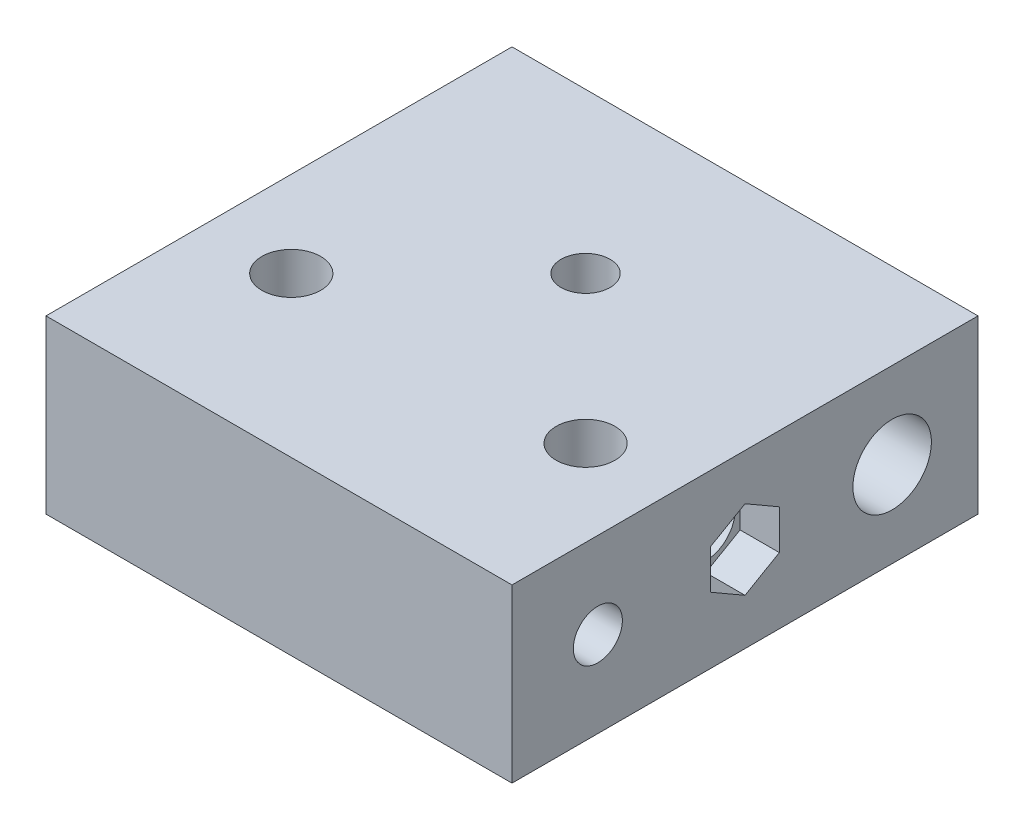
ISO-10303-21;
HEADER;
FILE_DESCRIPTION(('STEP AP214'),'2;1');
FILE_NAME('part.step','',(''),(''),'','','');
FILE_SCHEMA(('AUTOMOTIVE_DESIGN { 1 0 10303 214 1 1 1 1 }'));
ENDSEC;
DATA;
#1=APPLICATION_CONTEXT('core data for automotive mechanical design processes');
#2=APPLICATION_PROTOCOL_DEFINITION('international standard','automotive_design',2000,#1);
#3=PRODUCT_CONTEXT('',#1,'mechanical');
#4=PRODUCT('Part','Part','',(#3));
#5=PRODUCT_RELATED_PRODUCT_CATEGORY('part','',(#4));
#6=PRODUCT_DEFINITION_FORMATION('','',#4);
#7=PRODUCT_DEFINITION_CONTEXT('part definition',#1,'design');
#8=PRODUCT_DEFINITION('design','',#6,#7);
#9=PRODUCT_DEFINITION_SHAPE('','',#8);
#10=(LENGTH_UNIT() NAMED_UNIT(*) SI_UNIT(.MILLI.,.METRE.));
#11=(NAMED_UNIT(*) PLANE_ANGLE_UNIT() SI_UNIT($,.RADIAN.));
#12=(NAMED_UNIT(*) SI_UNIT($,.STERADIAN.) SOLID_ANGLE_UNIT());
#13=UNCERTAINTY_MEASURE_WITH_UNIT(LENGTH_MEASURE(1.E-05),#10,'distance_accuracy_value','');
#14=(GEOMETRIC_REPRESENTATION_CONTEXT(3) GLOBAL_UNCERTAINTY_ASSIGNED_CONTEXT((#13)) GLOBAL_UNIT_ASSIGNED_CONTEXT((#10,
#11,#12)) REPRESENTATION_CONTEXT('',''));
#15=CARTESIAN_POINT('',(0.,0.,0.));
#16=DIRECTION('',(0.,0.,1.));
#17=DIRECTION('',(1.,0.,0.));
#18=AXIS2_PLACEMENT_3D('',#15,#16,#17);
#19=CARTESIAN_POINT('',(47.5,0.,47.5));
#20=DIRECTION('',(-1.,0.,0.));
#21=DIRECTION('',(0.,-1.,0.));
#22=AXIS2_PLACEMENT_3D('',#19,#20,#21);
#23=CYLINDRICAL_SURFACE('',#22,5.99999999999999);
#24=CARTESIAN_POINT('',(-39.5,0.,47.5));
#25=DIRECTION('',(-1.,0.,0.));
#26=DIRECTION('',(0.,0.,1.));
#27=AXIS2_PLACEMENT_3D('',#24,#25,#26);
#28=CIRCLE('',#27,5.99999999999999);
#29=CARTESIAN_POINT('',(-39.5,0.,53.5));
#30=VERTEX_POINT('',#29);
#31=EDGE_CURVE('E276',#30,#30,#28,.F.);
#32=ORIENTED_EDGE('',*,*,#31,.F.);
#33=EDGE_LOOP('',(#32));
#34=FACE_BOUND('',#33,.T.);
#35=CARTESIAN_POINT('',(39.5,0.,47.5));
#36=DIRECTION('',(1.,0.,0.));
#37=DIRECTION('',(0.,0.,-1.));
#38=AXIS2_PLACEMENT_3D('',#35,#36,#37);
#39=CIRCLE('',#38,5.99999999999999);
#40=CARTESIAN_POINT('',(39.5,0.,41.5));
#41=VERTEX_POINT('',#40);
#42=EDGE_CURVE('E37',#41,#41,#39,.F.);
#43=ORIENTED_EDGE('',*,*,#42,.F.);
#44=EDGE_LOOP('',(#43));
#45=FACE_BOUND('',#44,.T.);
#46=ADVANCED_FACE('F33',(#34,#45),#23,.F.);
#47=CARTESIAN_POINT('',(0.,-17.5,32.5));
#48=DIRECTION('',(0.,1.,0.));
#49=DIRECTION('',(0.,0.,1.));
#50=AXIS2_PLACEMENT_3D('',#47,#48,#49);
#51=CYLINDRICAL_SURFACE('',#50,5.);
#52=CARTESIAN_POINT('',(0.,17.5,32.5));
#53=DIRECTION('',(0.,-1.,0.));
#54=DIRECTION('',(0.,0.,-1.));
#55=AXIS2_PLACEMENT_3D('',#52,#53,#54);
#56=CIRCLE('',#55,5.);
#57=CARTESIAN_POINT('',(0.,17.5,27.5));
#58=VERTEX_POINT('',#57);
#59=EDGE_CURVE('E349',#58,#58,#56,.T.);
#60=ORIENTED_EDGE('',*,*,#59,.F.);
#61=EDGE_LOOP('',(#60));
#62=FACE_BOUND('',#61,.T.);
#63=CARTESIAN_POINT('',(0.,-9.50000000000001,32.5));
#64=DIRECTION('',(0.,-1.,0.));
#65=DIRECTION('',(0.,0.,-1.));
#66=AXIS2_PLACEMENT_3D('',#63,#64,#65);
#67=CIRCLE('',#66,5.);
#68=CARTESIAN_POINT('',(0.,-9.50000000000001,27.5));
#69=VERTEX_POINT('',#68);
#70=EDGE_CURVE('E324',#69,#69,#67,.T.);
#71=ORIENTED_EDGE('',*,*,#70,.T.);
#72=EDGE_LOOP('',(#71));
#73=FACE_BOUND('',#72,.T.);
#74=ADVANCED_FACE('F420',(#62,#73),#51,.F.);
#75=CARTESIAN_POINT('',(30.,-17.5,62.5));
#76=DIRECTION('',(0.,1.,0.));
#77=DIRECTION('',(0.,0.,1.));
#78=AXIS2_PLACEMENT_3D('',#75,#76,#77);
#79=CYLINDRICAL_SURFACE('',#78,5.99999999999999);
#80=CARTESIAN_POINT('',(30.,17.5,62.5));
#81=DIRECTION('',(0.,-1.,0.));
#82=DIRECTION('',(0.,0.,-1.));
#83=AXIS2_PLACEMENT_3D('',#80,#81,#82);
#84=CIRCLE('',#83,5.99999999999999);
#85=CARTESIAN_POINT('',(30.,17.5,56.5));
#86=VERTEX_POINT('',#85);
#87=EDGE_CURVE('E342',#86,#86,#84,.T.);
#88=ORIENTED_EDGE('',*,*,#87,.F.);
#89=EDGE_LOOP('',(#88));
#90=FACE_BOUND('',#89,.T.);
#91=CARTESIAN_POINT('',(30.,8.49999999999999,62.5));
#92=DIRECTION('',(0.,-1.,0.));
#93=DIRECTION('',(0.,0.,-1.));
#94=AXIS2_PLACEMENT_3D('',#91,#92,#93);
#95=CIRCLE('',#94,5.99999999999999);
#96=CARTESIAN_POINT('',(30.,8.49999999999999,56.5));
#97=VERTEX_POINT('',#96);
#98=EDGE_CURVE('E338',#97,#97,#95,.T.);
#99=ORIENTED_EDGE('',*,*,#98,.T.);
#100=EDGE_LOOP('',(#99));
#101=FACE_BOUND('',#100,.T.);
#102=ADVANCED_FACE('F512',(#90,#101),#79,.F.);
#103=CARTESIAN_POINT('',(-47.5,17.5,95.));
#104=DIRECTION('',(0.,-1.,0.));
#105=DIRECTION('',(0.,0.,-1.));
#106=AXIS2_PLACEMENT_3D('',#103,#104,#105);
#107=PLANE('',#106);
#108=CARTESIAN_POINT('',(-30.,17.5,62.5));
#109=DIRECTION('',(0.,-1.,0.));
#110=DIRECTION('',(0.,0.,-1.));
#111=AXIS2_PLACEMENT_3D('',#108,#109,#110);
#112=CIRCLE('',#111,6.);
#113=CARTESIAN_POINT('',(-30.,17.5,56.5));
#114=VERTEX_POINT('',#113);
#115=EDGE_CURVE('E345',#114,#114,#112,.T.);
#116=ORIENTED_EDGE('',*,*,#115,.T.);
#117=EDGE_LOOP('',(#116));
#118=FACE_BOUND('',#117,.T.);
#119=DIRECTION('',(-1.,0.,0.));
#120=VECTOR('',#119,1.);
#121=CARTESIAN_POINT('',(-47.5,17.5,0.));
#122=LINE('',#121,#120);
#123=CARTESIAN_POINT('',(47.5,17.5,0.));
#124=VERTEX_POINT('',#123);
#125=CARTESIAN_POINT('',(-47.5,17.5,0.));
#126=VERTEX_POINT('',#125);
#127=EDGE_CURVE('E392',#124,#126,#122,.T.);
#128=ORIENTED_EDGE('',*,*,#127,.T.);
#129=DIRECTION('',(0.,0.,-1.));
#130=VECTOR('',#129,1.);
#131=CARTESIAN_POINT('',(-47.5,17.5,95.));
#132=LINE('',#131,#130);
#133=CARTESIAN_POINT('',(-47.5,17.5,95.));
#134=VERTEX_POINT('',#133);
#135=EDGE_CURVE('E42',#134,#126,#132,.T.);
#136=ORIENTED_EDGE('',*,*,#135,.F.);
#137=DIRECTION('',(-1.,0.,0.));
#138=VECTOR('',#137,1.);
#139=CARTESIAN_POINT('',(-47.5,17.5,95.));
#140=LINE('',#139,#138);
#141=CARTESIAN_POINT('',(47.5,17.5,95.));
#142=VERTEX_POINT('',#141);
#143=EDGE_CURVE('E382',#142,#134,#140,.T.);
#144=ORIENTED_EDGE('',*,*,#143,.F.);
#145=DIRECTION('',(0.,0.,-1.));
#146=VECTOR('',#145,1.);
#147=CARTESIAN_POINT('',(47.5,17.5,95.));
#148=LINE('',#147,#146);
#149=EDGE_CURVE('E11',#142,#124,#148,.T.);
#150=ORIENTED_EDGE('',*,*,#149,.T.);
#151=EDGE_LOOP('',(#128,#136,#144,#150));
#152=FACE_BOUND('',#151,.T.);
#153=ORIENTED_EDGE('',*,*,#59,.T.);
#154=EDGE_LOOP('',(#153));
#155=FACE_BOUND('',#154,.T.);
#156=ORIENTED_EDGE('',*,*,#87,.T.);
#157=EDGE_LOOP('',(#156));
#158=FACE_BOUND('',#157,.T.);
#159=ADVANCED_FACE('F515',(#118,#152,#155,#158),#107,.F.);
#160=CARTESIAN_POINT('',(-47.5,-17.5,95.));
#161=DIRECTION('',(0.,1.,0.));
#162=DIRECTION('',(0.,0.,1.));
#163=AXIS2_PLACEMENT_3D('',#160,#161,#162);
#164=PLANE('',#163);
#165=DIRECTION('',(-0.5,0.,0.866025403784438));
#166=VECTOR('',#165,1.);
#167=CARTESIAN_POINT('',(8.08290376865476,-17.5,32.5));
#168=LINE('',#167,#166);
#169=CARTESIAN_POINT('',(8.08290376865476,-17.5,32.5));
#170=VERTEX_POINT('',#169);
#171=CARTESIAN_POINT('',(4.04145188432738,-17.5,39.5));
#172=VERTEX_POINT('',#171);
#173=EDGE_CURVE('E308',#170,#172,#168,.T.);
#174=ORIENTED_EDGE('',*,*,#173,.F.);
#175=DIRECTION('',(0.5,0.,0.866025403784439));
#176=VECTOR('',#175,1.);
#177=CARTESIAN_POINT('',(4.04145188432738,-17.5,25.5));
#178=LINE('',#177,#176);
#179=CARTESIAN_POINT('',(4.04145188432738,-17.5,25.5));
#180=VERTEX_POINT('',#179);
#181=EDGE_CURVE('E306',#180,#170,#178,.T.);
#182=ORIENTED_EDGE('',*,*,#181,.F.);
#183=DIRECTION('',(1.,0.,0.));
#184=VECTOR('',#183,1.);
#185=CARTESIAN_POINT('',(-4.04145188432738,-17.5,25.5));
#186=LINE('',#185,#184);
#187=CARTESIAN_POINT('',(-4.04145188432738,-17.5,25.5));
#188=VERTEX_POINT('',#187);
#189=EDGE_CURVE('E290',#188,#180,#186,.T.);
#190=ORIENTED_EDGE('',*,*,#189,.F.);
#191=DIRECTION('',(0.5,0.,-0.866025403784438));
#192=VECTOR('',#191,1.);
#193=CARTESIAN_POINT('',(-8.08290376865476,-17.5,32.5));
#194=LINE('',#193,#192);
#195=CARTESIAN_POINT('',(-8.08290376865476,-17.5,32.5));
#196=VERTEX_POINT('',#195);
#197=EDGE_CURVE('E317',#196,#188,#194,.T.);
#198=ORIENTED_EDGE('',*,*,#197,.F.);
#199=DIRECTION('',(-0.5,0.,-0.866025403784439));
#200=VECTOR('',#199,1.);
#201=CARTESIAN_POINT('',(-4.04145188432738,-17.5,39.5));
#202=LINE('',#201,#200);
#203=CARTESIAN_POINT('',(-4.04145188432738,-17.5,39.5));
#204=VERTEX_POINT('',#203);
#205=EDGE_CURVE('E314',#204,#196,#202,.T.);
#206=ORIENTED_EDGE('',*,*,#205,.F.);
#207=DIRECTION('',(-1.,0.,0.));
#208=VECTOR('',#207,1.);
#209=CARTESIAN_POINT('',(4.04145188432738,-17.5,39.5));
#210=LINE('',#209,#208);
#211=EDGE_CURVE('E311',#172,#204,#210,.T.);
#212=ORIENTED_EDGE('',*,*,#211,.F.);
#213=EDGE_LOOP('',(#174,#182,#190,#198,#206,#212));
#214=FACE_BOUND('',#213,.T.);
#215=CARTESIAN_POINT('',(30.,-17.5,62.5));
#216=DIRECTION('',(0.,-1.,0.));
#217=DIRECTION('',(0.,0.,-1.));
#218=AXIS2_PLACEMENT_3D('',#215,#216,#217);
#219=CIRCLE('',#218,8.);
#220=CARTESIAN_POINT('',(30.,-17.5,54.5));
#221=VERTEX_POINT('',#220);
#222=EDGE_CURVE('E339',#221,#221,#219,.T.);
#223=ORIENTED_EDGE('',*,*,#222,.F.);
#224=EDGE_LOOP('',(#223));
#225=FACE_BOUND('',#224,.T.);
#226=CARTESIAN_POINT('',(-30.,-17.5,62.5));
#227=DIRECTION('',(0.,-1.,0.));
#228=DIRECTION('',(0.,0.,-1.));
#229=AXIS2_PLACEMENT_3D('',#226,#227,#228);
#230=CIRCLE('',#229,6.);
#231=CARTESIAN_POINT('',(-30.,-17.5,56.5));
#232=VERTEX_POINT('',#231);
#233=EDGE_CURVE('E346',#232,#232,#230,.T.);
#234=ORIENTED_EDGE('',*,*,#233,.F.);
#235=EDGE_LOOP('',(#234));
#236=FACE_BOUND('',#235,.T.);
#237=DIRECTION('',(1.,0.,0.));
#238=VECTOR('',#237,1.);
#239=CARTESIAN_POINT('',(-47.5,-17.5,0.));
#240=LINE('',#239,#238);
#241=CARTESIAN_POINT('',(-47.5,-17.5,0.));
#242=VERTEX_POINT('',#241);
#243=CARTESIAN_POINT('',(47.5,-17.5,0.));
#244=VERTEX_POINT('',#243);
#245=EDGE_CURVE('E383',#242,#244,#240,.T.);
#246=ORIENTED_EDGE('',*,*,#245,.T.);
#247=DIRECTION('',(0.,0.,-1.));
#248=VECTOR('',#247,1.);
#249=CARTESIAN_POINT('',(47.5,-17.5,95.));
#250=LINE('',#249,#248);
#251=CARTESIAN_POINT('',(47.5,-17.5,95.));
#252=VERTEX_POINT('',#251);
#253=EDGE_CURVE('E389',#252,#244,#250,.T.);
#254=ORIENTED_EDGE('',*,*,#253,.F.);
#255=DIRECTION('',(1.,0.,0.));
#256=VECTOR('',#255,1.);
#257=CARTESIAN_POINT('',(-47.5,-17.5,95.));
#258=LINE('',#257,#256);
#259=CARTESIAN_POINT('',(-47.5,-17.5,95.));
#260=VERTEX_POINT('',#259);
#261=EDGE_CURVE('E387',#260,#252,#258,.T.);
#262=ORIENTED_EDGE('',*,*,#261,.F.);
#263=DIRECTION('',(0.,0.,-1.));
#264=VECTOR('',#263,1.);
#265=CARTESIAN_POINT('',(-47.5,-17.5,95.));
#266=LINE('',#265,#264);
#267=EDGE_CURVE('E399',#260,#242,#266,.T.);
#268=ORIENTED_EDGE('',*,*,#267,.T.);
#269=EDGE_LOOP('',(#246,#254,#262,#268));
#270=FACE_BOUND('',#269,.T.);
#271=ADVANCED_FACE('F555',(#214,#225,#236,#270),#164,.F.);
#272=CARTESIAN_POINT('',(47.5,0.,17.5));
#273=DIRECTION('',(-1.,0.,0.));
#274=DIRECTION('',(0.,-1.,0.));
#275=AXIS2_PLACEMENT_3D('',#272,#273,#274);
#276=CYLINDRICAL_SURFACE('',#275,5.);
#277=CARTESIAN_POINT('',(-21.5,0.,17.5));
#278=DIRECTION('',(-1.,0.,0.));
#279=DIRECTION('',(0.,-1.,0.));
#280=AXIS2_PLACEMENT_3D('',#277,#278,#279);
#281=CIRCLE('',#280,5.);
#282=CARTESIAN_POINT('',(-21.5,-5.,17.5));
#283=VERTEX_POINT('',#282);
#284=EDGE_CURVE('E371',#283,#283,#281,.F.);
#285=ORIENTED_EDGE('',*,*,#284,.F.);
#286=EDGE_LOOP('',(#285));
#287=FACE_BOUND('',#286,.T.);
#288=CARTESIAN_POINT('',(21.5,0.,17.5));
#289=DIRECTION('',(1.,0.,0.));
#290=DIRECTION('',(0.,1.,0.));
#291=AXIS2_PLACEMENT_3D('',#288,#289,#290);
#292=CIRCLE('',#291,5.);
#293=CARTESIAN_POINT('',(21.5,5.,17.5));
#294=VERTEX_POINT('',#293);
#295=EDGE_CURVE('E358',#294,#294,#292,.F.);
#296=ORIENTED_EDGE('',*,*,#295,.F.);
#297=EDGE_LOOP('',(#296));
#298=FACE_BOUND('',#297,.T.);
#299=ADVANCED_FACE('F550',(#287,#298),#276,.F.);
#300=CARTESIAN_POINT('',(47.5,0.,77.5));
#301=DIRECTION('',(-1.,0.,0.));
#302=DIRECTION('',(0.,-1.,0.));
#303=AXIS2_PLACEMENT_3D('',#300,#301,#302);
#304=CYLINDRICAL_SURFACE('',#303,5.);
#305=CARTESIAN_POINT('',(47.5,0.,77.5));
#306=DIRECTION('',(-1.,0.,0.));
#307=DIRECTION('',(0.,-1.,0.));
#308=AXIS2_PLACEMENT_3D('',#305,#306,#307);
#309=CIRCLE('',#308,5.);
#310=CARTESIAN_POINT('',(47.5,-4.99999999999999,77.5));
#311=VERTEX_POINT('',#310);
#312=EDGE_CURVE('E375',#311,#311,#309,.T.);
#313=ORIENTED_EDGE('',*,*,#312,.F.);
#314=EDGE_LOOP('',(#313));
#315=FACE_BOUND('',#314,.T.);
#316=CARTESIAN_POINT('',(12.5,0.,77.5));
#317=DIRECTION('',(-1.,0.,0.));
#318=DIRECTION('',(0.,-1.,0.));
#319=AXIS2_PLACEMENT_3D('',#316,#317,#318);
#320=CIRCLE('',#319,5.);
#321=CARTESIAN_POINT('',(12.5,-5.,77.5));
#322=VERTEX_POINT('',#321);
#323=EDGE_CURVE('E364',#322,#322,#320,.F.);
#324=ORIENTED_EDGE('',*,*,#323,.F.);
#325=EDGE_LOOP('',(#324));
#326=FACE_BOUND('',#325,.T.);
#327=ADVANCED_FACE('F548',(#315,#326),#304,.F.);
#328=CARTESIAN_POINT('',(47.5,17.5,95.));
#329=DIRECTION('',(-1.,0.,0.));
#330=DIRECTION('',(0.,-1.,0.));
#331=AXIS2_PLACEMENT_3D('',#328,#329,#330);
#332=PLANE('',#331);
#333=DIRECTION('',(0.,0.5,-0.866025403784439));
#334=VECTOR('',#333,1.);
#335=CARTESIAN_POINT('',(47.5,-8.08290376865475,47.5));
#336=LINE('',#335,#334);
#337=CARTESIAN_POINT('',(47.5,-8.08290376865475,47.5));
#338=VERTEX_POINT('',#337);
#339=CARTESIAN_POINT('',(47.5,-4.04145188432737,40.5));
#340=VERTEX_POINT('',#339);
#341=EDGE_CURVE('E220',#338,#340,#336,.T.);
#342=ORIENTED_EDGE('',*,*,#341,.F.);
#343=DIRECTION('',(0.,-0.5,-0.866025403784439));
#344=VECTOR('',#343,1.);
#345=CARTESIAN_POINT('',(47.5,-4.04145188432736,54.5));
#346=LINE('',#345,#344);
#347=CARTESIAN_POINT('',(47.5,-4.04145188432736,54.5));
#348=VERTEX_POINT('',#347);
#349=EDGE_CURVE('E50',#348,#338,#346,.T.);
#350=ORIENTED_EDGE('',*,*,#349,.F.);
#351=DIRECTION('',(0.,-1.,0.));
#352=VECTOR('',#351,1.);
#353=CARTESIAN_POINT('',(47.5,4.04145188432738,54.5));
#354=LINE('',#353,#352);
#355=CARTESIAN_POINT('',(47.5,4.04145188432738,54.5));
#356=VERTEX_POINT('',#355);
#357=EDGE_CURVE('E206',#356,#348,#354,.T.);
#358=ORIENTED_EDGE('',*,*,#357,.F.);
#359=DIRECTION('',(0.,-0.5,0.866025403784439));
#360=VECTOR('',#359,1.);
#361=CARTESIAN_POINT('',(47.5,8.08290376865476,47.5));
#362=LINE('',#361,#360);
#363=CARTESIAN_POINT('',(47.5,8.08290376865476,47.5));
#364=VERTEX_POINT('',#363);
#365=EDGE_CURVE('E209',#364,#356,#362,.T.);
#366=ORIENTED_EDGE('',*,*,#365,.F.);
#367=DIRECTION('',(0.,0.5,0.866025403784438));
#368=VECTOR('',#367,1.);
#369=CARTESIAN_POINT('',(47.5,4.04145188432737,40.5));
#370=LINE('',#369,#368);
#371=CARTESIAN_POINT('',(47.5,4.04145188432737,40.5));
#372=VERTEX_POINT('',#371);
#373=EDGE_CURVE('E225',#372,#364,#370,.T.);
#374=ORIENTED_EDGE('',*,*,#373,.F.);
#375=DIRECTION('',(0.,1.,0.));
#376=VECTOR('',#375,1.);
#377=CARTESIAN_POINT('',(47.5,-4.04145188432737,40.5));
#378=LINE('',#377,#376);
#379=EDGE_CURVE('E222',#340,#372,#378,.T.);
#380=ORIENTED_EDGE('',*,*,#379,.F.);
#381=EDGE_LOOP('',(#342,#350,#358,#366,#374,#380));
#382=FACE_BOUND('',#381,.T.);
#383=CARTESIAN_POINT('',(47.5,0.,17.5));
#384=DIRECTION('',(1.,0.,0.));
#385=DIRECTION('',(0.,1.,0.));
#386=AXIS2_PLACEMENT_3D('',#383,#384,#385);
#387=CIRCLE('',#386,8.);
#388=CARTESIAN_POINT('',(47.5,8.00000000000001,17.5));
#389=VERTEX_POINT('',#388);
#390=EDGE_CURVE('E354',#389,#389,#387,.T.);
#391=ORIENTED_EDGE('',*,*,#390,.F.);
#392=EDGE_LOOP('',(#391));
#393=FACE_BOUND('',#392,.T.);
#394=ORIENTED_EDGE('',*,*,#312,.T.);
#395=EDGE_LOOP('',(#394));
#396=FACE_BOUND('',#395,.T.);
#397=DIRECTION('',(0.,1.,0.));
#398=VECTOR('',#397,1.);
#399=CARTESIAN_POINT('',(47.5,17.5,0.));
#400=LINE('',#399,#398);
#401=EDGE_CURVE('E378',#244,#124,#400,.T.);
#402=ORIENTED_EDGE('',*,*,#401,.T.);
#403=ORIENTED_EDGE('',*,*,#149,.F.);
#404=DIRECTION('',(0.,1.,0.));
#405=VECTOR('',#404,1.);
#406=CARTESIAN_POINT('',(47.5,17.5,95.));
#407=LINE('',#406,#405);
#408=EDGE_CURVE('E379',#252,#142,#407,.T.);
#409=ORIENTED_EDGE('',*,*,#408,.F.);
#410=ORIENTED_EDGE('',*,*,#253,.T.);
#411=EDGE_LOOP('',(#402,#403,#409,#410));
#412=FACE_BOUND('',#411,.T.);
#413=ADVANCED_FACE('F35',(#382,#393,#396,#412),#332,.F.);
#414=CARTESIAN_POINT('',(-47.5,17.5,95.));
#415=DIRECTION('',(1.,0.,0.));
#416=DIRECTION('',(0.,1.,0.));
#417=AXIS2_PLACEMENT_3D('',#414,#415,#416);
#418=PLANE('',#417);
#419=DIRECTION('',(0.,0.5,0.866025403784439));
#420=VECTOR('',#419,1.);
#421=CARTESIAN_POINT('',(-47.5,-8.08290376865477,47.5));
#422=LINE('',#421,#420);
#423=CARTESIAN_POINT('',(-47.5,-8.08290376865477,47.5));
#424=VERTEX_POINT('',#423);
#425=CARTESIAN_POINT('',(-47.5,-4.04145188432739,54.5));
#426=VERTEX_POINT('',#425);
#427=EDGE_CURVE('E260',#424,#426,#422,.T.);
#428=ORIENTED_EDGE('',*,*,#427,.F.);
#429=DIRECTION('',(0.,-0.5,0.866025403784438));
#430=VECTOR('',#429,1.);
#431=CARTESIAN_POINT('',(-47.5,-4.04145188432739,40.5));
#432=LINE('',#431,#430);
#433=CARTESIAN_POINT('',(-47.5,-4.04145188432739,40.5));
#434=VERTEX_POINT('',#433);
#435=EDGE_CURVE('E58',#434,#424,#432,.T.);
#436=ORIENTED_EDGE('',*,*,#435,.F.);
#437=DIRECTION('',(0.,-1.,0.));
#438=VECTOR('',#437,1.);
#439=CARTESIAN_POINT('',(-47.5,4.04145188432737,40.5));
#440=LINE('',#439,#438);
#441=CARTESIAN_POINT('',(-47.5,4.04145188432737,40.5));
#442=VERTEX_POINT('',#441);
#443=EDGE_CURVE('E243',#442,#434,#440,.T.);
#444=ORIENTED_EDGE('',*,*,#443,.F.);
#445=DIRECTION('',(0.,-0.5,-0.866025403784438));
#446=VECTOR('',#445,1.);
#447=CARTESIAN_POINT('',(-47.5,8.08290376865476,47.5));
#448=LINE('',#447,#446);
#449=CARTESIAN_POINT('',(-47.5,8.08290376865476,47.5));
#450=VERTEX_POINT('',#449);
#451=EDGE_CURVE('E269',#450,#442,#448,.T.);
#452=ORIENTED_EDGE('',*,*,#451,.F.);
#453=DIRECTION('',(0.,0.5,-0.866025403784439));
#454=VECTOR('',#453,1.);
#455=CARTESIAN_POINT('',(-47.5,4.04145188432738,54.5));
#456=LINE('',#455,#454);
#457=CARTESIAN_POINT('',(-47.5,4.04145188432738,54.5));
#458=VERTEX_POINT('',#457);
#459=EDGE_CURVE('E266',#458,#450,#456,.T.);
#460=ORIENTED_EDGE('',*,*,#459,.F.);
#461=DIRECTION('',(0.,1.,0.));
#462=VECTOR('',#461,1.);
#463=CARTESIAN_POINT('',(-47.5,-4.04145188432739,54.5));
#464=LINE('',#463,#462);
#465=EDGE_CURVE('E263',#426,#458,#464,.T.);
#466=ORIENTED_EDGE('',*,*,#465,.F.);
#467=EDGE_LOOP('',(#428,#436,#444,#452,#460,#466));
#468=FACE_BOUND('',#467,.T.);
#469=CARTESIAN_POINT('',(-47.5,0.,77.5));
#470=DIRECTION('',(-1.,0.,0.));
#471=DIRECTION('',(0.,-1.,0.));
#472=AXIS2_PLACEMENT_3D('',#469,#470,#471);
#473=CIRCLE('',#472,8.);
#474=CARTESIAN_POINT('',(-47.5,-8.00000000000001,77.5));
#475=VERTEX_POINT('',#474);
#476=EDGE_CURVE('E365',#475,#475,#473,.T.);
#477=ORIENTED_EDGE('',*,*,#476,.F.);
#478=EDGE_LOOP('',(#477));
#479=FACE_BOUND('',#478,.T.);
#480=CARTESIAN_POINT('',(-47.5,0.,17.5));
#481=DIRECTION('',(-1.,0.,0.));
#482=DIRECTION('',(0.,-1.,0.));
#483=AXIS2_PLACEMENT_3D('',#480,#481,#482);
#484=CIRCLE('',#483,8.);
#485=CARTESIAN_POINT('',(-47.5,-8.00000000000001,17.5));
#486=VERTEX_POINT('',#485);
#487=EDGE_CURVE('E372',#486,#486,#484,.T.);
#488=ORIENTED_EDGE('',*,*,#487,.F.);
#489=EDGE_LOOP('',(#488));
#490=FACE_BOUND('',#489,.T.);
#491=DIRECTION('',(0.,-1.,0.));
#492=VECTOR('',#491,1.);
#493=CARTESIAN_POINT('',(-47.5,17.5,0.));
#494=LINE('',#493,#492);
#495=EDGE_CURVE('E394',#126,#242,#494,.T.);
#496=ORIENTED_EDGE('',*,*,#495,.T.);
#497=ORIENTED_EDGE('',*,*,#267,.F.);
#498=DIRECTION('',(0.,-1.,0.));
#499=VECTOR('',#498,1.);
#500=CARTESIAN_POINT('',(-47.5,17.5,95.));
#501=LINE('',#500,#499);
#502=EDGE_CURVE('E385',#134,#260,#501,.T.);
#503=ORIENTED_EDGE('',*,*,#502,.F.);
#504=ORIENTED_EDGE('',*,*,#135,.T.);
#505=EDGE_LOOP('',(#496,#497,#503,#504));
#506=FACE_BOUND('',#505,.T.);
#507=ADVANCED_FACE('F560',(#468,#479,#490,#506),#418,.F.);
#508=CARTESIAN_POINT('',(0.,0.,95.));
#509=DIRECTION('',(0.,0.,1.));
#510=DIRECTION('',(1.,0.,0.));
#511=AXIS2_PLACEMENT_3D('',#508,#509,#510);
#512=PLANE('',#511);
#513=ORIENTED_EDGE('',*,*,#408,.T.);
#514=ORIENTED_EDGE('',*,*,#143,.T.);
#515=ORIENTED_EDGE('',*,*,#502,.T.);
#516=ORIENTED_EDGE('',*,*,#261,.T.);
#517=EDGE_LOOP('',(#513,#514,#515,#516));
#518=FACE_BOUND('',#517,.T.);
#519=ADVANCED_FACE('F557',(#518),#512,.T.);
#520=CARTESIAN_POINT('',(0.,0.,0.));
#521=DIRECTION('',(0.,0.,1.));
#522=DIRECTION('',(1.,0.,0.));
#523=AXIS2_PLACEMENT_3D('',#520,#521,#522);
#524=PLANE('',#523);
#525=ORIENTED_EDGE('',*,*,#401,.F.);
#526=ORIENTED_EDGE('',*,*,#245,.F.);
#527=ORIENTED_EDGE('',*,*,#495,.F.);
#528=ORIENTED_EDGE('',*,*,#127,.F.);
#529=EDGE_LOOP('',(#525,#526,#527,#528));
#530=FACE_BOUND('',#529,.T.);
#531=ADVANCED_FACE('F543',(#530),#524,.F.);
#532=CARTESIAN_POINT('',(-21.5,0.,17.5));
#533=DIRECTION('',(-1.,0.,0.));
#534=DIRECTION('',(0.,-1.,0.));
#535=AXIS2_PLACEMENT_3D('',#532,#533,#534);
#536=PLANE('',#535);
#537=CARTESIAN_POINT('',(-21.5,0.,17.5));
#538=DIRECTION('',(-1.,0.,0.));
#539=DIRECTION('',(0.,-1.,0.));
#540=AXIS2_PLACEMENT_3D('',#537,#538,#539);
#541=CIRCLE('',#540,8.);
#542=CARTESIAN_POINT('',(-21.5,-8.00000000000001,17.5));
#543=VERTEX_POINT('',#542);
#544=EDGE_CURVE('E368',#543,#543,#541,.T.);
#545=ORIENTED_EDGE('',*,*,#544,.T.);
#546=EDGE_LOOP('',(#545));
#547=FACE_BOUND('',#546,.T.);
#548=ORIENTED_EDGE('',*,*,#284,.T.);
#549=EDGE_LOOP('',(#548));
#550=FACE_BOUND('',#549,.T.);
#551=ADVANCED_FACE('F540',(#547,#550),#536,.T.);
#552=CARTESIAN_POINT('',(-21.5,0.,17.5));
#553=DIRECTION('',(-1.,0.,0.));
#554=DIRECTION('',(0.,-1.,0.));
#555=AXIS2_PLACEMENT_3D('',#552,#553,#554);
#556=CYLINDRICAL_SURFACE('',#555,8.);
#557=ORIENTED_EDGE('',*,*,#544,.F.);
#558=EDGE_LOOP('',(#557));
#559=FACE_BOUND('',#558,.T.);
#560=ORIENTED_EDGE('',*,*,#487,.T.);
#561=EDGE_LOOP('',(#560));
#562=FACE_BOUND('',#561,.T.);
#563=ADVANCED_FACE('F535',(#559,#562),#556,.F.);
#564=CARTESIAN_POINT('',(12.5,0.,77.5));
#565=DIRECTION('',(-1.,0.,0.));
#566=DIRECTION('',(0.,-1.,0.));
#567=AXIS2_PLACEMENT_3D('',#564,#565,#566);
#568=PLANE('',#567);
#569=CARTESIAN_POINT('',(12.5,0.,77.5));
#570=DIRECTION('',(-1.,0.,0.));
#571=DIRECTION('',(0.,-1.,0.));
#572=AXIS2_PLACEMENT_3D('',#569,#570,#571);
#573=CIRCLE('',#572,8.);
#574=CARTESIAN_POINT('',(12.5,-7.99999999999999,77.5));
#575=VERTEX_POINT('',#574);
#576=EDGE_CURVE('E361',#575,#575,#573,.T.);
#577=ORIENTED_EDGE('',*,*,#576,.T.);
#578=EDGE_LOOP('',(#577));
#579=FACE_BOUND('',#578,.T.);
#580=ORIENTED_EDGE('',*,*,#323,.T.);
#581=EDGE_LOOP('',(#580));
#582=FACE_BOUND('',#581,.T.);
#583=ADVANCED_FACE('F532',(#579,#582),#568,.T.);
#584=CARTESIAN_POINT('',(12.5,0.,77.5));
#585=DIRECTION('',(-1.,0.,0.));
#586=DIRECTION('',(0.,-1.,0.));
#587=AXIS2_PLACEMENT_3D('',#584,#585,#586);
#588=CYLINDRICAL_SURFACE('',#587,8.);
#589=ORIENTED_EDGE('',*,*,#576,.F.);
#590=EDGE_LOOP('',(#589));
#591=FACE_BOUND('',#590,.T.);
#592=ORIENTED_EDGE('',*,*,#476,.T.);
#593=EDGE_LOOP('',(#592));
#594=FACE_BOUND('',#593,.T.);
#595=ADVANCED_FACE('F527',(#591,#594),#588,.F.);
#596=CARTESIAN_POINT('',(21.5,0.,17.5));
#597=DIRECTION('',(1.,0.,0.));
#598=DIRECTION('',(0.,1.,0.));
#599=AXIS2_PLACEMENT_3D('',#596,#597,#598);
#600=PLANE('',#599);
#601=CARTESIAN_POINT('',(21.5,0.,17.5));
#602=DIRECTION('',(1.,0.,0.));
#603=DIRECTION('',(0.,1.,0.));
#604=AXIS2_PLACEMENT_3D('',#601,#602,#603);
#605=CIRCLE('',#604,8.);
#606=CARTESIAN_POINT('',(21.5,8.,17.5));
#607=VERTEX_POINT('',#606);
#608=EDGE_CURVE('E355',#607,#607,#605,.T.);
#609=ORIENTED_EDGE('',*,*,#608,.T.);
#610=EDGE_LOOP('',(#609));
#611=FACE_BOUND('',#610,.T.);
#612=ORIENTED_EDGE('',*,*,#295,.T.);
#613=EDGE_LOOP('',(#612));
#614=FACE_BOUND('',#613,.T.);
#615=ADVANCED_FACE('F524',(#611,#614),#600,.T.);
#616=CARTESIAN_POINT('',(21.5,0.,17.5));
#617=DIRECTION('',(1.,0.,0.));
#618=DIRECTION('',(0.,1.,0.));
#619=AXIS2_PLACEMENT_3D('',#616,#617,#618);
#620=CYLINDRICAL_SURFACE('',#619,8.);
#621=ORIENTED_EDGE('',*,*,#608,.F.);
#622=EDGE_LOOP('',(#621));
#623=FACE_BOUND('',#622,.T.);
#624=ORIENTED_EDGE('',*,*,#390,.T.);
#625=EDGE_LOOP('',(#624));
#626=FACE_BOUND('',#625,.T.);
#627=ADVANCED_FACE('F519',(#623,#626),#620,.F.);
#628=CARTESIAN_POINT('',(-30.,-17.5,62.5));
#629=DIRECTION('',(0.,1.,0.));
#630=DIRECTION('',(0.,0.,1.));
#631=AXIS2_PLACEMENT_3D('',#628,#629,#630);
#632=CYLINDRICAL_SURFACE('',#631,6.);
#633=ORIENTED_EDGE('',*,*,#233,.T.);
#634=EDGE_LOOP('',(#633));
#635=FACE_BOUND('',#634,.T.);
#636=ORIENTED_EDGE('',*,*,#115,.F.);
#637=EDGE_LOOP('',(#636));
#638=FACE_BOUND('',#637,.T.);
#639=ADVANCED_FACE('F510',(#635,#638),#632,.F.);
#640=CARTESIAN_POINT('',(30.,8.49999999999999,62.5));
#641=DIRECTION('',(0.,-1.,0.));
#642=DIRECTION('',(0.,0.,-1.));
#643=AXIS2_PLACEMENT_3D('',#640,#641,#642);
#644=CYLINDRICAL_SURFACE('',#643,8.);
#645=CARTESIAN_POINT('',(30.,8.49999999999999,62.5));
#646=DIRECTION('',(0.,-1.,0.));
#647=DIRECTION('',(0.,0.,-1.));
#648=AXIS2_PLACEMENT_3D('',#645,#646,#647);
#649=CIRCLE('',#648,8.);
#650=CARTESIAN_POINT('',(30.,8.49999999999999,54.5));
#651=VERTEX_POINT('',#650);
#652=EDGE_CURVE('E335',#651,#651,#649,.T.);
#653=ORIENTED_EDGE('',*,*,#652,.F.);
#654=EDGE_LOOP('',(#653));
#655=FACE_BOUND('',#654,.T.);
#656=ORIENTED_EDGE('',*,*,#222,.T.);
#657=EDGE_LOOP('',(#656));
#658=FACE_BOUND('',#657,.T.);
#659=ADVANCED_FACE('F506',(#655,#658),#644,.F.);
#660=CARTESIAN_POINT('',(30.,8.49999999999999,62.5));
#661=DIRECTION('',(0.,-1.,0.));
#662=DIRECTION('',(0.,0.,-1.));
#663=AXIS2_PLACEMENT_3D('',#660,#661,#662);
#664=PLANE('',#663);
#665=ORIENTED_EDGE('',*,*,#98,.F.);
#666=EDGE_LOOP('',(#665));
#667=FACE_BOUND('',#666,.T.);
#668=ORIENTED_EDGE('',*,*,#652,.T.);
#669=EDGE_LOOP('',(#668));
#670=FACE_BOUND('',#669,.T.);
#671=ADVANCED_FACE('F502',(#667,#670),#664,.T.);
#672=CARTESIAN_POINT('',(4.04145188432738,-9.50000000000001,25.5));
#673=DIRECTION('',(0.866025403784439,0.,-0.5));
#674=DIRECTION('',(-0.5,0.,-0.866025403784439));
#675=AXIS2_PLACEMENT_3D('',#672,#673,#674);
#676=PLANE('',#675);
#677=ORIENTED_EDGE('',*,*,#181,.T.);
#678=DIRECTION('',(0.,-1.,0.));
#679=VECTOR('',#678,1.);
#680=CARTESIAN_POINT('',(8.08290376865476,-9.50000000000001,32.5));
#681=LINE('',#680,#679);
#682=CARTESIAN_POINT('',(8.08290376865476,-9.50000000000001,32.5));
#683=VERTEX_POINT('',#682);
#684=EDGE_CURVE('E305',#683,#170,#681,.T.);
#685=ORIENTED_EDGE('',*,*,#684,.F.);
#686=DIRECTION('',(0.5,0.,0.866025403784439));
#687=VECTOR('',#686,1.);
#688=CARTESIAN_POINT('',(4.04145188432738,-9.50000000000001,25.5));
#689=LINE('',#688,#687);
#690=CARTESIAN_POINT('',(4.04145188432738,-9.50000000000001,25.5));
#691=VERTEX_POINT('',#690);
#692=EDGE_CURVE('E286',#691,#683,#689,.T.);
#693=ORIENTED_EDGE('',*,*,#692,.F.);
#694=DIRECTION('',(0.,-1.,0.));
#695=VECTOR('',#694,1.);
#696=CARTESIAN_POINT('',(4.04145188432738,-9.50000000000001,25.5));
#697=LINE('',#696,#695);
#698=EDGE_CURVE('E322',#691,#180,#697,.T.);
#699=ORIENTED_EDGE('',*,*,#698,.T.);
#700=EDGE_LOOP('',(#677,#685,#693,#699));
#701=FACE_BOUND('',#700,.T.);
#702=ADVANCED_FACE('F484',(#701),#676,.F.);
#703=CARTESIAN_POINT('',(-4.04145188432738,-9.50000000000001,25.5));
#704=DIRECTION('',(0.,0.,-1.));
#705=DIRECTION('',(-1.,0.,0.));
#706=AXIS2_PLACEMENT_3D('',#703,#704,#705);
#707=PLANE('',#706);
#708=ORIENTED_EDGE('',*,*,#189,.T.);
#709=ORIENTED_EDGE('',*,*,#698,.F.);
#710=DIRECTION('',(1.,0.,0.));
#711=VECTOR('',#710,1.);
#712=CARTESIAN_POINT('',(-4.04145188432738,-9.50000000000001,25.5));
#713=LINE('',#712,#711);
#714=CARTESIAN_POINT('',(-4.04145188432738,-9.50000000000001,25.5));
#715=VERTEX_POINT('',#714);
#716=EDGE_CURVE('E302',#715,#691,#713,.T.);
#717=ORIENTED_EDGE('',*,*,#716,.F.);
#718=DIRECTION('',(0.,-1.,0.));
#719=VECTOR('',#718,1.);
#720=CARTESIAN_POINT('',(-4.04145188432738,-9.50000000000001,25.5));
#721=LINE('',#720,#719);
#722=EDGE_CURVE('E325',#715,#188,#721,.T.);
#723=ORIENTED_EDGE('',*,*,#722,.T.);
#724=EDGE_LOOP('',(#708,#709,#717,#723));
#725=FACE_BOUND('',#724,.T.);
#726=ADVANCED_FACE('F480',(#725),#707,.F.);
#727=CARTESIAN_POINT('',(-8.08290376865476,-9.50000000000001,32.5));
#728=DIRECTION('',(-0.866025403784438,0.,-0.5));
#729=DIRECTION('',(-0.5,0.,0.866025403784439));
#730=AXIS2_PLACEMENT_3D('',#727,#728,#729);
#731=PLANE('',#730);
#732=ORIENTED_EDGE('',*,*,#197,.T.);
#733=ORIENTED_EDGE('',*,*,#722,.F.);
#734=DIRECTION('',(0.5,0.,-0.866025403784438));
#735=VECTOR('',#734,1.);
#736=CARTESIAN_POINT('',(-8.08290376865476,-9.50000000000001,32.5));
#737=LINE('',#736,#735);
#738=CARTESIAN_POINT('',(-8.08290376865476,-9.50000000000001,32.5));
#739=VERTEX_POINT('',#738);
#740=EDGE_CURVE('E299',#739,#715,#737,.T.);
#741=ORIENTED_EDGE('',*,*,#740,.F.);
#742=DIRECTION('',(0.,-1.,0.));
#743=VECTOR('',#742,1.);
#744=CARTESIAN_POINT('',(-8.08290376865476,-9.50000000000001,32.5));
#745=LINE('',#744,#743);
#746=EDGE_CURVE('E327',#739,#196,#745,.T.);
#747=ORIENTED_EDGE('',*,*,#746,.T.);
#748=EDGE_LOOP('',(#732,#733,#741,#747));
#749=FACE_BOUND('',#748,.T.);
#750=ADVANCED_FACE('F483',(#749),#731,.F.);
#751=CARTESIAN_POINT('',(-4.04145188432738,-9.50000000000001,39.5));
#752=DIRECTION('',(-0.866025403784439,0.,0.5));
#753=DIRECTION('',(0.5,0.,0.866025403784439));
#754=AXIS2_PLACEMENT_3D('',#751,#752,#753);
#755=PLANE('',#754);
#756=ORIENTED_EDGE('',*,*,#205,.T.);
#757=ORIENTED_EDGE('',*,*,#746,.F.);
#758=DIRECTION('',(-0.5,0.,-0.866025403784439));
#759=VECTOR('',#758,1.);
#760=CARTESIAN_POINT('',(-4.04145188432738,-9.50000000000001,39.5));
#761=LINE('',#760,#759);
#762=CARTESIAN_POINT('',(-4.04145188432738,-9.50000000000001,39.5));
#763=VERTEX_POINT('',#762);
#764=EDGE_CURVE('E296',#763,#739,#761,.T.);
#765=ORIENTED_EDGE('',*,*,#764,.F.);
#766=DIRECTION('',(0.,-1.,0.));
#767=VECTOR('',#766,1.);
#768=CARTESIAN_POINT('',(-4.04145188432738,-9.50000000000001,39.5));
#769=LINE('',#768,#767);
#770=EDGE_CURVE('E329',#763,#204,#769,.T.);
#771=ORIENTED_EDGE('',*,*,#770,.T.);
#772=EDGE_LOOP('',(#756,#757,#765,#771));
#773=FACE_BOUND('',#772,.T.);
#774=ADVANCED_FACE('F488',(#773),#755,.F.);
#775=CARTESIAN_POINT('',(4.04145188432738,-9.50000000000001,39.5));
#776=DIRECTION('',(0.,0.,1.));
#777=DIRECTION('',(1.,0.,0.));
#778=AXIS2_PLACEMENT_3D('',#775,#776,#777);
#779=PLANE('',#778);
#780=ORIENTED_EDGE('',*,*,#211,.T.);
#781=ORIENTED_EDGE('',*,*,#770,.F.);
#782=DIRECTION('',(-1.,0.,0.));
#783=VECTOR('',#782,1.);
#784=CARTESIAN_POINT('',(4.04145188432738,-9.50000000000001,39.5));
#785=LINE('',#784,#783);
#786=CARTESIAN_POINT('',(4.04145188432738,-9.50000000000001,39.5));
#787=VERTEX_POINT('',#786);
#788=EDGE_CURVE('E293',#787,#763,#785,.T.);
#789=ORIENTED_EDGE('',*,*,#788,.F.);
#790=DIRECTION('',(0.,-1.,0.));
#791=VECTOR('',#790,1.);
#792=CARTESIAN_POINT('',(4.04145188432738,-9.50000000000001,39.5));
#793=LINE('',#792,#791);
#794=EDGE_CURVE('E331',#787,#172,#793,.T.);
#795=ORIENTED_EDGE('',*,*,#794,.T.);
#796=EDGE_LOOP('',(#780,#781,#789,#795));
#797=FACE_BOUND('',#796,.T.);
#798=ADVANCED_FACE('F492',(#797),#779,.F.);
#799=CARTESIAN_POINT('',(8.08290376865476,-9.50000000000001,32.5));
#800=DIRECTION('',(0.866025403784439,0.,0.5));
#801=DIRECTION('',(0.5,0.,-0.866025403784438));
#802=AXIS2_PLACEMENT_3D('',#799,#800,#801);
#803=PLANE('',#802);
#804=ORIENTED_EDGE('',*,*,#173,.T.);
#805=ORIENTED_EDGE('',*,*,#794,.F.);
#806=DIRECTION('',(-0.5,0.,0.866025403784438));
#807=VECTOR('',#806,1.);
#808=CARTESIAN_POINT('',(8.08290376865476,-9.50000000000001,32.5));
#809=LINE('',#808,#807);
#810=EDGE_CURVE('E289',#683,#787,#809,.T.);
#811=ORIENTED_EDGE('',*,*,#810,.F.);
#812=ORIENTED_EDGE('',*,*,#684,.T.);
#813=EDGE_LOOP('',(#804,#805,#811,#812));
#814=FACE_BOUND('',#813,.T.);
#815=ADVANCED_FACE('F478',(#814),#803,.F.);
#816=CARTESIAN_POINT('',(0.,-9.50000000000001,0.));
#817=DIRECTION('',(0.,-1.,0.));
#818=DIRECTION('',(0.,0.,-1.));
#819=AXIS2_PLACEMENT_3D('',#816,#817,#818);
#820=PLANE('',#819);
#821=ORIENTED_EDGE('',*,*,#70,.F.);
#822=EDGE_LOOP('',(#821));
#823=FACE_BOUND('',#822,.T.);
#824=ORIENTED_EDGE('',*,*,#692,.T.);
#825=ORIENTED_EDGE('',*,*,#810,.T.);
#826=ORIENTED_EDGE('',*,*,#788,.T.);
#827=ORIENTED_EDGE('',*,*,#764,.T.);
#828=ORIENTED_EDGE('',*,*,#740,.T.);
#829=ORIENTED_EDGE('',*,*,#716,.T.);
#830=EDGE_LOOP('',(#824,#825,#826,#827,#828,#829));
#831=FACE_BOUND('',#830,.T.);
#832=ADVANCED_FACE('F457',(#823,#831),#820,.T.);
#833=CARTESIAN_POINT('',(-39.5,0.,0.));
#834=DIRECTION('',(-1.,0.,0.));
#835=DIRECTION('',(0.,0.,1.));
#836=AXIS2_PLACEMENT_3D('',#833,#834,#835);
#837=PLANE('',#836);
#838=DIRECTION('',(0.,-0.5,0.866025403784438));
#839=VECTOR('',#838,1.);
#840=CARTESIAN_POINT('',(-39.5,-4.04145188432739,40.5));
#841=LINE('',#840,#839);
#842=CARTESIAN_POINT('',(-39.5,-4.04145188432739,40.5));
#843=VERTEX_POINT('',#842);
#844=CARTESIAN_POINT('',(-39.5,-8.08290376865477,47.5));
#845=VERTEX_POINT('',#844);
#846=EDGE_CURVE('E239',#843,#845,#841,.T.);
#847=ORIENTED_EDGE('',*,*,#846,.T.);
#848=DIRECTION('',(0.,0.5,0.866025403784439));
#849=VECTOR('',#848,1.);
#850=CARTESIAN_POINT('',(-39.5,-8.08290376865477,47.5));
#851=LINE('',#850,#849);
#852=CARTESIAN_POINT('',(-39.5,-4.04145188432739,54.5));
#853=VERTEX_POINT('',#852);
#854=EDGE_CURVE('E242',#845,#853,#851,.T.);
#855=ORIENTED_EDGE('',*,*,#854,.T.);
#856=DIRECTION('',(0.,1.,0.));
#857=VECTOR('',#856,1.);
#858=CARTESIAN_POINT('',(-39.5,-4.04145188432739,54.5));
#859=LINE('',#858,#857);
#860=CARTESIAN_POINT('',(-39.5,4.04145188432739,54.5));
#861=VERTEX_POINT('',#860);
#862=EDGE_CURVE('E246',#853,#861,#859,.T.);
#863=ORIENTED_EDGE('',*,*,#862,.T.);
#864=DIRECTION('',(0.,0.5,-0.866025403784439));
#865=VECTOR('',#864,1.);
#866=CARTESIAN_POINT('',(-39.5,4.04145188432739,54.5));
#867=LINE('',#866,#865);
#868=CARTESIAN_POINT('',(-39.5,8.08290376865476,47.5));
#869=VERTEX_POINT('',#868);
#870=EDGE_CURVE('E249',#861,#869,#867,.T.);
#871=ORIENTED_EDGE('',*,*,#870,.T.);
#872=DIRECTION('',(0.,-0.5,-0.866025403784438));
#873=VECTOR('',#872,1.);
#874=CARTESIAN_POINT('',(-39.5,8.08290376865476,47.5));
#875=LINE('',#874,#873);
#876=CARTESIAN_POINT('',(-39.5,4.04145188432738,40.5));
#877=VERTEX_POINT('',#876);
#878=EDGE_CURVE('E252',#869,#877,#875,.T.);
#879=ORIENTED_EDGE('',*,*,#878,.T.);
#880=DIRECTION('',(0.,-1.,0.));
#881=VECTOR('',#880,1.);
#882=CARTESIAN_POINT('',(-39.5,4.04145188432738,40.5));
#883=LINE('',#882,#881);
#884=EDGE_CURVE('E255',#877,#843,#883,.T.);
#885=ORIENTED_EDGE('',*,*,#884,.T.);
#886=EDGE_LOOP('',(#847,#855,#863,#871,#879,#885));
#887=FACE_BOUND('',#886,.T.);
#888=ORIENTED_EDGE('',*,*,#31,.T.);
#889=EDGE_LOOP('',(#888));
#890=FACE_BOUND('',#889,.T.);
#891=ADVANCED_FACE('F416',(#887,#890),#837,.T.);
#892=CARTESIAN_POINT('',(-39.5,-4.04145188432739,40.5));
#893=DIRECTION('',(0.,-0.866025403784438,-0.5));
#894=DIRECTION('',(0.,0.5,-0.866025403784439));
#895=AXIS2_PLACEMENT_3D('',#892,#893,#894);
#896=PLANE('',#895);
#897=ORIENTED_EDGE('',*,*,#435,.T.);
#898=DIRECTION('',(-1.,0.,0.));
#899=VECTOR('',#898,1.);
#900=CARTESIAN_POINT('',(-39.5,-8.08290376865477,47.5));
#901=LINE('',#900,#899);
#902=EDGE_CURVE('E258',#845,#424,#901,.T.);
#903=ORIENTED_EDGE('',*,*,#902,.F.);
#904=ORIENTED_EDGE('',*,*,#846,.F.);
#905=DIRECTION('',(-1.,0.,0.));
#906=VECTOR('',#905,1.);
#907=CARTESIAN_POINT('',(-39.5,-4.04145188432739,40.5));
#908=LINE('',#907,#906);
#909=EDGE_CURVE('E274',#843,#434,#908,.T.);
#910=ORIENTED_EDGE('',*,*,#909,.T.);
#911=EDGE_LOOP('',(#897,#903,#904,#910));
#912=FACE_BOUND('',#911,.T.);
#913=ADVANCED_FACE('F456',(#912),#896,.F.);
#914=CARTESIAN_POINT('',(-39.5,4.04145188432738,40.5));
#915=DIRECTION('',(0.,0.,-1.));
#916=DIRECTION('',(-1.,0.,0.));
#917=AXIS2_PLACEMENT_3D('',#914,#915,#916);
#918=PLANE('',#917);
#919=ORIENTED_EDGE('',*,*,#443,.T.);
#920=ORIENTED_EDGE('',*,*,#909,.F.);
#921=ORIENTED_EDGE('',*,*,#884,.F.);
#922=DIRECTION('',(-1.,0.,0.));
#923=VECTOR('',#922,1.);
#924=CARTESIAN_POINT('',(-39.5,4.04145188432738,40.5));
#925=LINE('',#924,#923);
#926=EDGE_CURVE('E277',#877,#442,#925,.T.);
#927=ORIENTED_EDGE('',*,*,#926,.T.);
#928=EDGE_LOOP('',(#919,#920,#921,#927));
#929=FACE_BOUND('',#928,.T.);
#930=ADVANCED_FACE('F459',(#929),#918,.F.);
#931=CARTESIAN_POINT('',(-39.5,8.08290376865476,47.5));
#932=DIRECTION('',(0.,0.866025403784439,-0.5));
#933=DIRECTION('',(0.,0.5,0.866025403784438));
#934=AXIS2_PLACEMENT_3D('',#931,#932,#933);
#935=PLANE('',#934);
#936=ORIENTED_EDGE('',*,*,#451,.T.);
#937=ORIENTED_EDGE('',*,*,#926,.F.);
#938=ORIENTED_EDGE('',*,*,#878,.F.);
#939=DIRECTION('',(-1.,0.,0.));
#940=VECTOR('',#939,1.);
#941=CARTESIAN_POINT('',(-39.5,8.08290376865476,47.5));
#942=LINE('',#941,#940);
#943=EDGE_CURVE('E279',#869,#450,#942,.T.);
#944=ORIENTED_EDGE('',*,*,#943,.T.);
#945=EDGE_LOOP('',(#936,#937,#938,#944));
#946=FACE_BOUND('',#945,.T.);
#947=ADVANCED_FACE('F462',(#946),#935,.F.);
#948=CARTESIAN_POINT('',(-39.5,4.04145188432739,54.5));
#949=DIRECTION('',(0.,0.866025403784439,0.5));
#950=DIRECTION('',(0.,-0.5,0.866025403784439));
#951=AXIS2_PLACEMENT_3D('',#948,#949,#950);
#952=PLANE('',#951);
#953=ORIENTED_EDGE('',*,*,#459,.T.);
#954=ORIENTED_EDGE('',*,*,#943,.F.);
#955=ORIENTED_EDGE('',*,*,#870,.F.);
#956=DIRECTION('',(-1.,0.,0.));
#957=VECTOR('',#956,1.);
#958=CARTESIAN_POINT('',(-39.5,4.04145188432739,54.5));
#959=LINE('',#958,#957);
#960=EDGE_CURVE('E281',#861,#458,#959,.T.);
#961=ORIENTED_EDGE('',*,*,#960,.T.);
#962=EDGE_LOOP('',(#953,#954,#955,#961));
#963=FACE_BOUND('',#962,.T.);
#964=ADVANCED_FACE('F466',(#963),#952,.F.);
#965=CARTESIAN_POINT('',(-39.5,-4.04145188432739,54.5));
#966=DIRECTION('',(0.,0.,1.));
#967=DIRECTION('',(1.,0.,0.));
#968=AXIS2_PLACEMENT_3D('',#965,#966,#967);
#969=PLANE('',#968);
#970=ORIENTED_EDGE('',*,*,#465,.T.);
#971=ORIENTED_EDGE('',*,*,#960,.F.);
#972=ORIENTED_EDGE('',*,*,#862,.F.);
#973=DIRECTION('',(-1.,0.,0.));
#974=VECTOR('',#973,1.);
#975=CARTESIAN_POINT('',(-39.5,-4.04145188432739,54.5));
#976=LINE('',#975,#974);
#977=EDGE_CURVE('E283',#853,#426,#976,.T.);
#978=ORIENTED_EDGE('',*,*,#977,.T.);
#979=EDGE_LOOP('',(#970,#971,#972,#978));
#980=FACE_BOUND('',#979,.T.);
#981=ADVANCED_FACE('F433',(#980),#969,.F.);
#982=CARTESIAN_POINT('',(-39.5,-8.08290376865477,47.5));
#983=DIRECTION('',(0.,-0.866025403784439,0.5));
#984=DIRECTION('',(0.,-0.5,-0.866025403784439));
#985=AXIS2_PLACEMENT_3D('',#982,#983,#984);
#986=PLANE('',#985);
#987=ORIENTED_EDGE('',*,*,#427,.T.);
#988=ORIENTED_EDGE('',*,*,#977,.F.);
#989=ORIENTED_EDGE('',*,*,#854,.F.);
#990=ORIENTED_EDGE('',*,*,#902,.T.);
#991=EDGE_LOOP('',(#987,#988,#989,#990));
#992=FACE_BOUND('',#991,.T.);
#993=ADVANCED_FACE('F425',(#992),#986,.F.);
#994=CARTESIAN_POINT('',(39.5,0.,0.));
#995=DIRECTION('',(1.,0.,0.));
#996=DIRECTION('',(0.,0.,-1.));
#997=AXIS2_PLACEMENT_3D('',#994,#995,#996);
#998=PLANE('',#997);
#999=DIRECTION('',(0.,-0.5,-0.866025403784439));
#1000=VECTOR('',#999,1.);
#1001=CARTESIAN_POINT('',(39.5,-4.04145188432737,54.5));
#1002=LINE('',#1001,#1000);
#1003=CARTESIAN_POINT('',(39.5,-4.04145188432737,54.5));
#1004=VERTEX_POINT('',#1003);
#1005=CARTESIAN_POINT('',(39.5,-8.08290376865475,47.5));
#1006=VERTEX_POINT('',#1005);
#1007=EDGE_CURVE('E186',#1004,#1006,#1002,.T.);
#1008=ORIENTED_EDGE('',*,*,#1007,.T.);
#1009=DIRECTION('',(0.,0.5,-0.866025403784439));
#1010=VECTOR('',#1009,1.);
#1011=CARTESIAN_POINT('',(39.5,-8.08290376865475,47.5));
#1012=LINE('',#1011,#1010);
#1013=CARTESIAN_POINT('',(39.5,-4.04145188432737,40.5));
#1014=VERTEX_POINT('',#1013);
#1015=EDGE_CURVE('E195',#1006,#1014,#1012,.T.);
#1016=ORIENTED_EDGE('',*,*,#1015,.T.);
#1017=DIRECTION('',(0.,1.,0.));
#1018=VECTOR('',#1017,1.);
#1019=CARTESIAN_POINT('',(39.5,-4.04145188432737,40.5));
#1020=LINE('',#1019,#1018);
#1021=CARTESIAN_POINT('',(39.5,4.04145188432737,40.5));
#1022=VERTEX_POINT('',#1021);
#1023=EDGE_CURVE('E200',#1014,#1022,#1020,.T.);
#1024=ORIENTED_EDGE('',*,*,#1023,.T.);
#1025=DIRECTION('',(0.,0.5,0.866025403784438));
#1026=VECTOR('',#1025,1.);
#1027=CARTESIAN_POINT('',(39.5,4.04145188432737,40.5));
#1028=LINE('',#1027,#1026);
#1029=CARTESIAN_POINT('',(39.5,8.08290376865476,47.5));
#1030=VERTEX_POINT('',#1029);
#1031=EDGE_CURVE('E213',#1022,#1030,#1028,.T.);
#1032=ORIENTED_EDGE('',*,*,#1031,.T.);
#1033=DIRECTION('',(0.,-0.5,0.866025403784439));
#1034=VECTOR('',#1033,1.);
#1035=CARTESIAN_POINT('',(39.5,8.08290376865476,47.5));
#1036=LINE('',#1035,#1034);
#1037=CARTESIAN_POINT('',(39.5,4.04145188432738,54.5));
#1038=VERTEX_POINT('',#1037);
#1039=EDGE_CURVE('E216',#1030,#1038,#1036,.T.);
#1040=ORIENTED_EDGE('',*,*,#1039,.T.);
#1041=DIRECTION('',(0.,-1.,0.));
#1042=VECTOR('',#1041,1.);
#1043=CARTESIAN_POINT('',(39.5,4.04145188432738,54.5));
#1044=LINE('',#1043,#1042);
#1045=EDGE_CURVE('E192',#1038,#1004,#1044,.T.);
#1046=ORIENTED_EDGE('',*,*,#1045,.T.);
#1047=EDGE_LOOP('',(#1008,#1016,#1024,#1032,#1040,#1046));
#1048=FACE_BOUND('',#1047,.T.);
#1049=ORIENTED_EDGE('',*,*,#42,.T.);
#1050=EDGE_LOOP('',(#1049));
#1051=FACE_BOUND('',#1050,.T.);
#1052=ADVANCED_FACE('F202',(#1048,#1051),#998,.T.);
#1053=CARTESIAN_POINT('',(39.5,-4.04145188432737,54.5));
#1054=DIRECTION('',(0.,-0.866025403784439,0.5));
#1055=DIRECTION('',(0.,-0.5,-0.866025403784439));
#1056=AXIS2_PLACEMENT_3D('',#1053,#1054,#1055);
#1057=PLANE('',#1056);
#1058=ORIENTED_EDGE('',*,*,#349,.T.);
#1059=DIRECTION('',(1.,0.,0.));
#1060=VECTOR('',#1059,1.);
#1061=CARTESIAN_POINT('',(39.5,-8.08290376865475,47.5));
#1062=LINE('',#1061,#1060);
#1063=EDGE_CURVE('E182',#1006,#338,#1062,.T.);
#1064=ORIENTED_EDGE('',*,*,#1063,.F.);
#1065=ORIENTED_EDGE('',*,*,#1007,.F.);
#1066=DIRECTION('',(1.,0.,0.));
#1067=VECTOR('',#1066,1.);
#1068=CARTESIAN_POINT('',(39.5,-4.04145188432737,54.5));
#1069=LINE('',#1068,#1067);
#1070=EDGE_CURVE('E230',#1004,#348,#1069,.T.);
#1071=ORIENTED_EDGE('',*,*,#1070,.T.);
#1072=EDGE_LOOP('',(#1058,#1064,#1065,#1071));
#1073=FACE_BOUND('',#1072,.T.);
#1074=ADVANCED_FACE('F184',(#1073),#1057,.F.);
#1075=CARTESIAN_POINT('',(39.5,4.04145188432738,54.5));
#1076=DIRECTION('',(0.,0.,1.));
#1077=DIRECTION('',(1.,0.,0.));
#1078=AXIS2_PLACEMENT_3D('',#1075,#1076,#1077);
#1079=PLANE('',#1078);
#1080=ORIENTED_EDGE('',*,*,#357,.T.);
#1081=ORIENTED_EDGE('',*,*,#1070,.F.);
#1082=ORIENTED_EDGE('',*,*,#1045,.F.);
#1083=DIRECTION('',(1.,0.,0.));
#1084=VECTOR('',#1083,1.);
#1085=CARTESIAN_POINT('',(39.5,4.04145188432738,54.5));
#1086=LINE('',#1085,#1084);
#1087=EDGE_CURVE('E232',#1038,#356,#1086,.T.);
#1088=ORIENTED_EDGE('',*,*,#1087,.T.);
#1089=EDGE_LOOP('',(#1080,#1081,#1082,#1088));
#1090=FACE_BOUND('',#1089,.T.);
#1091=ADVANCED_FACE('F431',(#1090),#1079,.F.);
#1092=CARTESIAN_POINT('',(39.5,8.08290376865476,47.5));
#1093=DIRECTION('',(0.,0.866025403784439,0.5));
#1094=DIRECTION('',(0.,-0.5,0.866025403784439));
#1095=AXIS2_PLACEMENT_3D('',#1092,#1093,#1094);
#1096=PLANE('',#1095);
#1097=ORIENTED_EDGE('',*,*,#365,.T.);
#1098=ORIENTED_EDGE('',*,*,#1087,.F.);
#1099=ORIENTED_EDGE('',*,*,#1039,.F.);
#1100=DIRECTION('',(1.,0.,0.));
#1101=VECTOR('',#1100,1.);
#1102=CARTESIAN_POINT('',(39.5,8.08290376865476,47.5));
#1103=LINE('',#1102,#1101);
#1104=EDGE_CURVE('E234',#1030,#364,#1103,.T.);
#1105=ORIENTED_EDGE('',*,*,#1104,.T.);
#1106=EDGE_LOOP('',(#1097,#1098,#1099,#1105));
#1107=FACE_BOUND('',#1106,.T.);
#1108=ADVANCED_FACE('F439',(#1107),#1096,.F.);
#1109=CARTESIAN_POINT('',(39.5,4.04145188432737,40.5));
#1110=DIRECTION('',(0.,0.866025403784438,-0.5));
#1111=DIRECTION('',(0.,0.5,0.866025403784439));
#1112=AXIS2_PLACEMENT_3D('',#1109,#1110,#1111);
#1113=PLANE('',#1112);
#1114=ORIENTED_EDGE('',*,*,#373,.T.);
#1115=ORIENTED_EDGE('',*,*,#1104,.F.);
#1116=ORIENTED_EDGE('',*,*,#1031,.F.);
#1117=DIRECTION('',(1.,0.,0.));
#1118=VECTOR('',#1117,1.);
#1119=CARTESIAN_POINT('',(39.5,4.04145188432737,40.5));
#1120=LINE('',#1119,#1118);
#1121=EDGE_CURVE('E236',#1022,#372,#1120,.T.);
#1122=ORIENTED_EDGE('',*,*,#1121,.T.);
#1123=EDGE_LOOP('',(#1114,#1115,#1116,#1122));
#1124=FACE_BOUND('',#1123,.T.);
#1125=ADVANCED_FACE('F443',(#1124),#1113,.F.);
#1126=CARTESIAN_POINT('',(39.5,-4.04145188432737,40.5));
#1127=DIRECTION('',(0.,0.,-1.));
#1128=DIRECTION('',(-1.,0.,0.));
#1129=AXIS2_PLACEMENT_3D('',#1126,#1127,#1128);
#1130=PLANE('',#1129);
#1131=ORIENTED_EDGE('',*,*,#379,.T.);
#1132=ORIENTED_EDGE('',*,*,#1121,.F.);
#1133=ORIENTED_EDGE('',*,*,#1023,.F.);
#1134=DIRECTION('',(1.,0.,0.));
#1135=VECTOR('',#1134,1.);
#1136=CARTESIAN_POINT('',(39.5,-4.04145188432737,40.5));
#1137=LINE('',#1136,#1135);
#1138=EDGE_CURVE('E191',#1014,#340,#1137,.T.);
#1139=ORIENTED_EDGE('',*,*,#1138,.T.);
#1140=EDGE_LOOP('',(#1131,#1132,#1133,#1139));
#1141=FACE_BOUND('',#1140,.T.);
#1142=ADVANCED_FACE('F447',(#1141),#1130,.F.);
#1143=CARTESIAN_POINT('',(39.5,-8.08290376865475,47.5));
#1144=DIRECTION('',(0.,-0.866025403784439,-0.5));
#1145=DIRECTION('',(0.,0.5,-0.866025403784439));
#1146=AXIS2_PLACEMENT_3D('',#1143,#1144,#1145);
#1147=PLANE('',#1146);
#1148=ORIENTED_EDGE('',*,*,#341,.T.);
#1149=ORIENTED_EDGE('',*,*,#1138,.F.);
#1150=ORIENTED_EDGE('',*,*,#1015,.F.);
#1151=ORIENTED_EDGE('',*,*,#1063,.T.);
#1152=EDGE_LOOP('',(#1148,#1149,#1150,#1151));
#1153=FACE_BOUND('',#1152,.T.);
#1154=ADVANCED_FACE('F196',(#1153),#1147,.F.);
#1155=CLOSED_SHELL('',(#46,#74,#102,#159,#271,#299,#327,#413,#507,#519,#531,#551,#563,#583,#595,
#615,#627,#639,#659,#671,#702,#726,#750,#774,#798,#815,#832,#891,#913,#930,#947,#964,#981,#993,
#1052,#1074,#1091,#1108,#1125,#1142,#1154));
#1156=MANIFOLD_SOLID_BREP('B2',#1155);
#1157=ADVANCED_BREP_SHAPE_REPRESENTATION('',(#18,#1156),#14);
#1158=SHAPE_DEFINITION_REPRESENTATION(#9,#1157);
ENDSEC;
END-ISO-10303-21;
